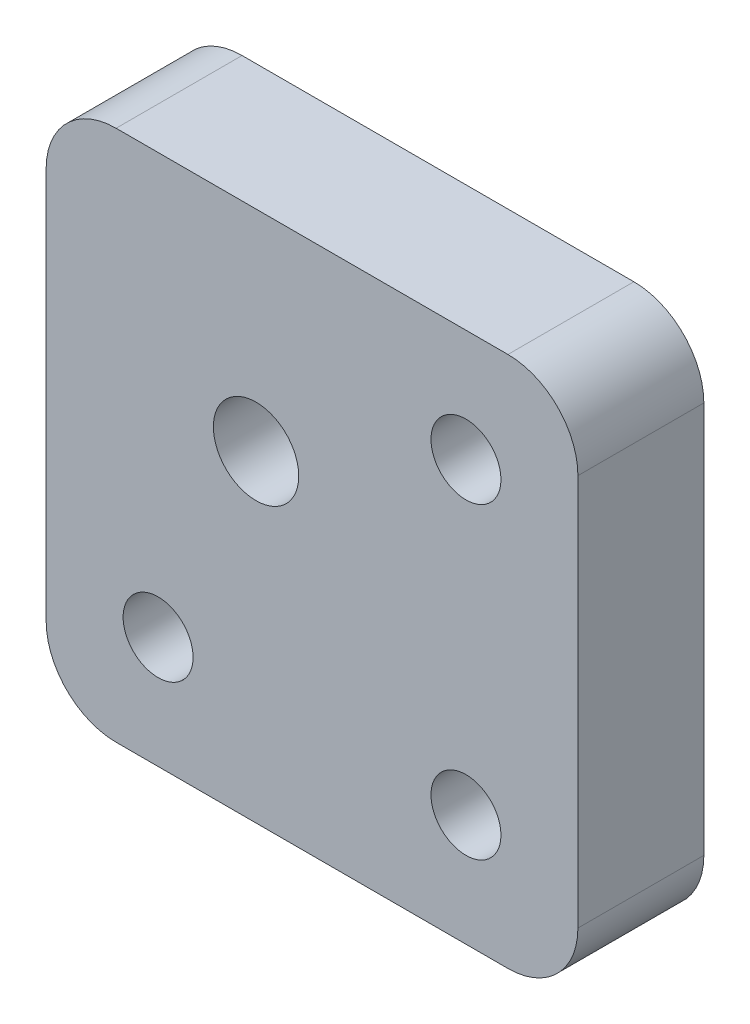
ISO-10303-21;
HEADER;
FILE_DESCRIPTION(('STEP AP214'),'2;1');
FILE_NAME('part.step','',(''),(''),'','','');
FILE_SCHEMA(('AUTOMOTIVE_DESIGN { 1 0 10303 214 1 1 1 1 }'));
ENDSEC;
DATA;
#1=APPLICATION_CONTEXT('core data for automotive mechanical design processes');
#2=APPLICATION_PROTOCOL_DEFINITION('international standard','automotive_design',2000,#1);
#3=PRODUCT_CONTEXT('',#1,'mechanical');
#4=PRODUCT('Part','Part','',(#3));
#5=PRODUCT_RELATED_PRODUCT_CATEGORY('part','',(#4));
#6=PRODUCT_DEFINITION_FORMATION('','',#4);
#7=PRODUCT_DEFINITION_CONTEXT('part definition',#1,'design');
#8=PRODUCT_DEFINITION('design','',#6,#7);
#9=PRODUCT_DEFINITION_SHAPE('','',#8);
#10=(LENGTH_UNIT() NAMED_UNIT(*) SI_UNIT(.MILLI.,.METRE.));
#11=(NAMED_UNIT(*) PLANE_ANGLE_UNIT() SI_UNIT($,.RADIAN.));
#12=(NAMED_UNIT(*) SI_UNIT($,.STERADIAN.) SOLID_ANGLE_UNIT());
#13=UNCERTAINTY_MEASURE_WITH_UNIT(LENGTH_MEASURE(1.E-05),#10,'distance_accuracy_value','');
#14=(GEOMETRIC_REPRESENTATION_CONTEXT(3) GLOBAL_UNCERTAINTY_ASSIGNED_CONTEXT((#13)) GLOBAL_UNIT_ASSIGNED_CONTEXT((#10,
#11,#12)) REPRESENTATION_CONTEXT('',''));
#15=CARTESIAN_POINT('',(0.,0.,0.));
#16=DIRECTION('',(0.,0.,1.));
#17=DIRECTION('',(1.,0.,0.));
#18=AXIS2_PLACEMENT_3D('',#15,#16,#17);
#19=CARTESIAN_POINT('',(0.,0.,9.));
#20=DIRECTION('',(0.,0.,1.));
#21=DIRECTION('',(1.,0.,0.));
#22=AXIS2_PLACEMENT_3D('',#19,#20,#21);
#23=PLANE('',#22);
#24=CARTESIAN_POINT('',(-13.1697995889595,-10.1602209944751,9.));
#25=DIRECTION('',(0.,0.,1.));
#26=DIRECTION('',(1.,0.,0.));
#27=AXIS2_PLACEMENT_3D('',#24,#25,#26);
#28=CIRCLE('',#27,2.5);
#29=CARTESIAN_POINT('',(-10.6697995889595,-10.1602209944751,9.));
#30=VERTEX_POINT('',#29);
#31=EDGE_CURVE('E188',#30,#30,#28,.T.);
#32=ORIENTED_EDGE('',*,*,#31,.F.);
#33=EDGE_LOOP('',(#32));
#34=FACE_BOUND('',#33,.T.);
#35=CARTESIAN_POINT('',(8.83020041104048,11.8397790055249,9.));
#36=DIRECTION('',(0.,0.,1.));
#37=DIRECTION('',(1.,0.,0.));
#38=AXIS2_PLACEMENT_3D('',#35,#36,#37);
#39=CIRCLE('',#38,2.5);
#40=CARTESIAN_POINT('',(11.3302004110405,11.8397790055249,9.));
#41=VERTEX_POINT('',#40);
#42=EDGE_CURVE('E129',#41,#41,#39,.T.);
#43=ORIENTED_EDGE('',*,*,#42,.F.);
#44=EDGE_LOOP('',(#43));
#45=FACE_BOUND('',#44,.T.);
#46=DIRECTION('',(-1.,0.,0.));
#47=VECTOR('',#46,1.);
#48=CARTESIAN_POINT('',(-21.1697995889595,19.8397790055249,9.));
#49=LINE('',#48,#47);
#50=CARTESIAN_POINT('',(11.8302004110405,19.8397790055249,9.));
#51=VERTEX_POINT('',#50);
#52=CARTESIAN_POINT('',(-16.1697995889595,19.8397790055249,9.));
#53=VERTEX_POINT('',#52);
#54=EDGE_CURVE('E138',#51,#53,#49,.T.);
#55=ORIENTED_EDGE('',*,*,#54,.T.);
#56=CARTESIAN_POINT('',(-16.1697995889595,14.8397790055249,9.));
#57=DIRECTION('',(0.,0.,1.));
#58=DIRECTION('',(1.,0.,0.));
#59=AXIS2_PLACEMENT_3D('',#56,#57,#58);
#60=CIRCLE('',#59,5.);
#61=CARTESIAN_POINT('',(-21.1697995889595,14.8397790055249,9.));
#62=VERTEX_POINT('',#61);
#63=EDGE_CURVE('E157',#53,#62,#60,.T.);
#64=ORIENTED_EDGE('',*,*,#63,.T.);
#65=DIRECTION('',(0.,-1.,0.));
#66=VECTOR('',#65,1.);
#67=CARTESIAN_POINT('',(-21.1697995889595,19.8397790055249,9.));
#68=LINE('',#67,#66);
#69=CARTESIAN_POINT('',(-21.1697995889595,-13.1602209944751,9.));
#70=VERTEX_POINT('',#69);
#71=EDGE_CURVE('E121',#62,#70,#68,.T.);
#72=ORIENTED_EDGE('',*,*,#71,.T.);
#73=CARTESIAN_POINT('',(-16.1697995889595,-13.1602209944751,9.));
#74=DIRECTION('',(0.,0.,1.));
#75=DIRECTION('',(1.,0.,0.));
#76=AXIS2_PLACEMENT_3D('',#73,#74,#75);
#77=CIRCLE('',#76,5.);
#78=CARTESIAN_POINT('',(-16.1697995889595,-18.1602209944751,9.));
#79=VERTEX_POINT('',#78);
#80=EDGE_CURVE('E155',#70,#79,#77,.T.);
#81=ORIENTED_EDGE('',*,*,#80,.T.);
#82=DIRECTION('',(1.,0.,0.));
#83=VECTOR('',#82,1.);
#84=CARTESIAN_POINT('',(-21.1697995889595,-18.1602209944751,9.));
#85=LINE('',#84,#83);
#86=CARTESIAN_POINT('',(11.8302004110405,-18.1602209944751,9.));
#87=VERTEX_POINT('',#86);
#88=EDGE_CURVE('E168',#79,#87,#85,.T.);
#89=ORIENTED_EDGE('',*,*,#88,.T.);
#90=CARTESIAN_POINT('',(11.8302004110405,-13.1602209944751,9.));
#91=DIRECTION('',(0.,0.,1.));
#92=DIRECTION('',(1.,0.,0.));
#93=AXIS2_PLACEMENT_3D('',#90,#91,#92);
#94=CIRCLE('',#93,5.);
#95=CARTESIAN_POINT('',(16.8302004110405,-13.1602209944751,9.));
#96=VERTEX_POINT('',#95);
#97=EDGE_CURVE('E56',#87,#96,#94,.T.);
#98=ORIENTED_EDGE('',*,*,#97,.T.);
#99=DIRECTION('',(0.,1.,0.));
#100=VECTOR('',#99,1.);
#101=CARTESIAN_POINT('',(16.8302004110405,19.8397790055249,9.));
#102=LINE('',#101,#100);
#103=CARTESIAN_POINT('',(16.8302004110405,14.8397790055249,9.));
#104=VERTEX_POINT('',#103);
#105=EDGE_CURVE('E176',#96,#104,#102,.T.);
#106=ORIENTED_EDGE('',*,*,#105,.T.);
#107=CARTESIAN_POINT('',(11.8302004110405,14.8397790055249,9.));
#108=DIRECTION('',(0.,0.,1.));
#109=DIRECTION('',(1.,0.,0.));
#110=AXIS2_PLACEMENT_3D('',#107,#108,#109);
#111=CIRCLE('',#110,5.);
#112=EDGE_CURVE('E152',#104,#51,#111,.T.);
#113=ORIENTED_EDGE('',*,*,#112,.T.);
#114=EDGE_LOOP('',(#55,#64,#72,#81,#89,#98,#106,#113));
#115=FACE_BOUND('',#114,.T.);
#116=CARTESIAN_POINT('',(8.83020041104049,-10.1602209944751,9.));
#117=DIRECTION('',(0.,0.,1.));
#118=DIRECTION('',(1.,0.,0.));
#119=AXIS2_PLACEMENT_3D('',#116,#117,#118);
#120=CIRCLE('',#119,2.5);
#121=CARTESIAN_POINT('',(11.3302004110405,-10.1602209944751,9.));
#122=VERTEX_POINT('',#121);
#123=EDGE_CURVE('E183',#122,#122,#120,.T.);
#124=ORIENTED_EDGE('',*,*,#123,.F.);
#125=EDGE_LOOP('',(#124));
#126=FACE_BOUND('',#125,.T.);
#127=CARTESIAN_POINT('',(-6.16979958895952,4.83977900552487,9.));
#128=DIRECTION('',(0.,0.,1.));
#129=DIRECTION('',(1.,0.,0.));
#130=AXIS2_PLACEMENT_3D('',#127,#128,#129);
#131=CIRCLE('',#130,3.05);
#132=CARTESIAN_POINT('',(-3.11979958895952,4.83977900552487,9.));
#133=VERTEX_POINT('',#132);
#134=EDGE_CURVE('E194',#133,#133,#131,.T.);
#135=ORIENTED_EDGE('',*,*,#134,.F.);
#136=EDGE_LOOP('',(#135));
#137=FACE_BOUND('',#136,.T.);
#138=ADVANCED_FACE('F35',(#34,#45,#115,#126,#137),#23,.T.);
#139=CARTESIAN_POINT('',(0.,0.,0.));
#140=DIRECTION('',(0.,0.,1.));
#141=DIRECTION('',(1.,0.,0.));
#142=AXIS2_PLACEMENT_3D('',#139,#140,#141);
#143=PLANE('',#142);
#144=DIRECTION('',(0.,-1.,0.));
#145=VECTOR('',#144,1.);
#146=CARTESIAN_POINT('',(-21.1697995889595,19.8397790055249,0.));
#147=LINE('',#146,#145);
#148=CARTESIAN_POINT('',(-21.1697995889595,14.8397790055249,0.));
#149=VERTEX_POINT('',#148);
#150=CARTESIAN_POINT('',(-21.1697995889595,-13.1602209944751,0.));
#151=VERTEX_POINT('',#150);
#152=EDGE_CURVE('E118',#149,#151,#147,.T.);
#153=ORIENTED_EDGE('',*,*,#152,.F.);
#154=CARTESIAN_POINT('',(-16.1697995889595,14.8397790055249,0.));
#155=DIRECTION('',(0.,0.,1.));
#156=DIRECTION('',(1.,0.,0.));
#157=AXIS2_PLACEMENT_3D('',#154,#155,#156);
#158=CIRCLE('',#157,5.);
#159=CARTESIAN_POINT('',(-16.1697995889595,19.8397790055249,0.));
#160=VERTEX_POINT('',#159);
#161=EDGE_CURVE('E101',#149,#160,#158,.F.);
#162=ORIENTED_EDGE('',*,*,#161,.T.);
#163=DIRECTION('',(-1.,0.,0.));
#164=VECTOR('',#163,1.);
#165=CARTESIAN_POINT('',(-21.1697995889595,19.8397790055249,0.));
#166=LINE('',#165,#164);
#167=CARTESIAN_POINT('',(11.8302004110405,19.8397790055249,0.));
#168=VERTEX_POINT('',#167);
#169=EDGE_CURVE('E142',#168,#160,#166,.T.);
#170=ORIENTED_EDGE('',*,*,#169,.F.);
#171=CARTESIAN_POINT('',(11.8302004110405,14.8397790055249,0.));
#172=DIRECTION('',(0.,0.,1.));
#173=DIRECTION('',(1.,0.,0.));
#174=AXIS2_PLACEMENT_3D('',#171,#172,#173);
#175=CIRCLE('',#174,5.);
#176=CARTESIAN_POINT('',(16.8302004110405,14.8397790055249,0.));
#177=VERTEX_POINT('',#176);
#178=EDGE_CURVE('E122',#168,#177,#175,.F.);
#179=ORIENTED_EDGE('',*,*,#178,.T.);
#180=DIRECTION('',(0.,1.,0.));
#181=VECTOR('',#180,1.);
#182=CARTESIAN_POINT('',(16.8302004110405,19.8397790055249,0.));
#183=LINE('',#182,#181);
#184=CARTESIAN_POINT('',(16.8302004110405,-13.1602209944751,0.));
#185=VERTEX_POINT('',#184);
#186=EDGE_CURVE('E132',#185,#177,#183,.T.);
#187=ORIENTED_EDGE('',*,*,#186,.F.);
#188=CARTESIAN_POINT('',(11.8302004110405,-13.1602209944751,0.));
#189=DIRECTION('',(0.,0.,1.));
#190=DIRECTION('',(1.,0.,0.));
#191=AXIS2_PLACEMENT_3D('',#188,#189,#190);
#192=CIRCLE('',#191,5.);
#193=CARTESIAN_POINT('',(11.8302004110405,-18.1602209944751,0.));
#194=VERTEX_POINT('',#193);
#195=EDGE_CURVE('E146',#185,#194,#192,.F.);
#196=ORIENTED_EDGE('',*,*,#195,.T.);
#197=DIRECTION('',(1.,0.,0.));
#198=VECTOR('',#197,1.);
#199=CARTESIAN_POINT('',(-21.1697995889595,-18.1602209944751,0.));
#200=LINE('',#199,#198);
#201=CARTESIAN_POINT('',(-16.1697995889595,-18.1602209944751,0.));
#202=VERTEX_POINT('',#201);
#203=EDGE_CURVE('E128',#202,#194,#200,.T.);
#204=ORIENTED_EDGE('',*,*,#203,.F.);
#205=CARTESIAN_POINT('',(-16.1697995889595,-13.1602209944751,0.));
#206=DIRECTION('',(0.,0.,1.));
#207=DIRECTION('',(1.,0.,0.));
#208=AXIS2_PLACEMENT_3D('',#205,#206,#207);
#209=CIRCLE('',#208,5.);
#210=EDGE_CURVE('E112',#202,#151,#209,.F.);
#211=ORIENTED_EDGE('',*,*,#210,.T.);
#212=EDGE_LOOP('',(#153,#162,#170,#179,#187,#196,#204,#211));
#213=FACE_BOUND('',#212,.T.);
#214=CARTESIAN_POINT('',(8.83020041104048,11.8397790055249,0.));
#215=DIRECTION('',(0.,0.,1.));
#216=DIRECTION('',(1.,0.,0.));
#217=AXIS2_PLACEMENT_3D('',#214,#215,#216);
#218=CIRCLE('',#217,2.5);
#219=CARTESIAN_POINT('',(11.3302004110405,11.8397790055249,0.));
#220=VERTEX_POINT('',#219);
#221=EDGE_CURVE('E135',#220,#220,#218,.T.);
#222=ORIENTED_EDGE('',*,*,#221,.T.);
#223=EDGE_LOOP('',(#222));
#224=FACE_BOUND('',#223,.T.);
#225=CARTESIAN_POINT('',(8.83020041104049,-10.1602209944751,0.));
#226=DIRECTION('',(0.,0.,1.));
#227=DIRECTION('',(1.,0.,0.));
#228=AXIS2_PLACEMENT_3D('',#225,#226,#227);
#229=CIRCLE('',#228,2.5);
#230=CARTESIAN_POINT('',(11.3302004110405,-10.1602209944751,0.));
#231=VERTEX_POINT('',#230);
#232=EDGE_CURVE('E185',#231,#231,#229,.T.);
#233=ORIENTED_EDGE('',*,*,#232,.T.);
#234=EDGE_LOOP('',(#233));
#235=FACE_BOUND('',#234,.T.);
#236=CARTESIAN_POINT('',(-13.1697995889595,-10.1602209944751,0.));
#237=DIRECTION('',(0.,0.,1.));
#238=DIRECTION('',(1.,0.,0.));
#239=AXIS2_PLACEMENT_3D('',#236,#237,#238);
#240=CIRCLE('',#239,2.5);
#241=CARTESIAN_POINT('',(-10.6697995889595,-10.1602209944751,0.));
#242=VERTEX_POINT('',#241);
#243=EDGE_CURVE('E191',#242,#242,#240,.T.);
#244=ORIENTED_EDGE('',*,*,#243,.T.);
#245=EDGE_LOOP('',(#244));
#246=FACE_BOUND('',#245,.T.);
#247=CARTESIAN_POINT('',(-6.16979958895952,4.83977900552487,0.));
#248=DIRECTION('',(0.,0.,1.));
#249=DIRECTION('',(1.,0.,0.));
#250=AXIS2_PLACEMENT_3D('',#247,#248,#249);
#251=CIRCLE('',#250,3.05);
#252=CARTESIAN_POINT('',(-3.11979958895952,4.83977900552487,0.));
#253=VERTEX_POINT('',#252);
#254=EDGE_CURVE('E197',#253,#253,#251,.T.);
#255=ORIENTED_EDGE('',*,*,#254,.T.);
#256=EDGE_LOOP('',(#255));
#257=FACE_BOUND('',#256,.T.);
#258=ADVANCED_FACE('F125',(#213,#224,#235,#246,#257),#143,.F.);
#259=CARTESIAN_POINT('',(-21.1697995889595,19.8397790055249,9.));
#260=DIRECTION('',(1.,0.,0.));
#261=DIRECTION('',(0.,1.,0.));
#262=AXIS2_PLACEMENT_3D('',#259,#260,#261);
#263=PLANE('',#262);
#264=ORIENTED_EDGE('',*,*,#71,.F.);
#265=DIRECTION('',(0.,0.,-1.));
#266=VECTOR('',#265,1.);
#267=CARTESIAN_POINT('',(-21.1697995889595,14.8397790055249,9.));
#268=LINE('',#267,#266);
#269=EDGE_CURVE('E105',#62,#149,#268,.T.);
#270=ORIENTED_EDGE('',*,*,#269,.T.);
#271=ORIENTED_EDGE('',*,*,#152,.T.);
#272=DIRECTION('',(0.,0.,-1.));
#273=VECTOR('',#272,1.);
#274=CARTESIAN_POINT('',(-21.1697995889595,-13.1602209944751,9.));
#275=LINE('',#274,#273);
#276=EDGE_CURVE('E123',#151,#70,#275,.F.);
#277=ORIENTED_EDGE('',*,*,#276,.T.);
#278=EDGE_LOOP('',(#264,#270,#271,#277));
#279=FACE_BOUND('',#278,.T.);
#280=ADVANCED_FACE('F117',(#279),#263,.F.);
#281=CARTESIAN_POINT('',(-21.1697995889595,-18.1602209944751,9.));
#282=DIRECTION('',(0.,1.,0.));
#283=DIRECTION('',(0.,0.,1.));
#284=AXIS2_PLACEMENT_3D('',#281,#282,#283);
#285=PLANE('',#284);
#286=ORIENTED_EDGE('',*,*,#88,.F.);
#287=DIRECTION('',(0.,0.,-1.));
#288=VECTOR('',#287,1.);
#289=CARTESIAN_POINT('',(-16.1697995889595,-18.1602209944751,9.));
#290=LINE('',#289,#288);
#291=EDGE_CURVE('E161',#79,#202,#290,.T.);
#292=ORIENTED_EDGE('',*,*,#291,.T.);
#293=ORIENTED_EDGE('',*,*,#203,.T.);
#294=DIRECTION('',(0.,0.,-1.));
#295=VECTOR('',#294,1.);
#296=CARTESIAN_POINT('',(11.8302004110405,-18.1602209944751,9.));
#297=LINE('',#296,#295);
#298=EDGE_CURVE('E159',#194,#87,#297,.F.);
#299=ORIENTED_EDGE('',*,*,#298,.T.);
#300=EDGE_LOOP('',(#286,#292,#293,#299));
#301=FACE_BOUND('',#300,.T.);
#302=ADVANCED_FACE('F166',(#301),#285,.F.);
#303=CARTESIAN_POINT('',(16.8302004110405,19.8397790055249,9.));
#304=DIRECTION('',(-1.,0.,0.));
#305=DIRECTION('',(0.,-1.,0.));
#306=AXIS2_PLACEMENT_3D('',#303,#304,#305);
#307=PLANE('',#306);
#308=ORIENTED_EDGE('',*,*,#105,.F.);
#309=DIRECTION('',(0.,0.,-1.));
#310=VECTOR('',#309,1.);
#311=CARTESIAN_POINT('',(16.8302004110405,-13.1602209944751,9.));
#312=LINE('',#311,#310);
#313=EDGE_CURVE('E11',#96,#185,#312,.T.);
#314=ORIENTED_EDGE('',*,*,#313,.T.);
#315=ORIENTED_EDGE('',*,*,#186,.T.);
#316=DIRECTION('',(0.,0.,-1.));
#317=VECTOR('',#316,1.);
#318=CARTESIAN_POINT('',(16.8302004110405,14.8397790055249,9.));
#319=LINE('',#318,#317);
#320=EDGE_CURVE('E43',#177,#104,#319,.F.);
#321=ORIENTED_EDGE('',*,*,#320,.T.);
#322=EDGE_LOOP('',(#308,#314,#315,#321));
#323=FACE_BOUND('',#322,.T.);
#324=ADVANCED_FACE('F175',(#323),#307,.F.);
#325=CARTESIAN_POINT('',(-21.1697995889595,19.8397790055249,9.));
#326=DIRECTION('',(0.,-1.,0.));
#327=DIRECTION('',(1.,0.,0.));
#328=AXIS2_PLACEMENT_3D('',#325,#326,#327);
#329=PLANE('',#328);
#330=ORIENTED_EDGE('',*,*,#169,.T.);
#331=DIRECTION('',(0.,0.,-1.));
#332=VECTOR('',#331,1.);
#333=CARTESIAN_POINT('',(-16.1697995889595,19.8397790055249,9.));
#334=LINE('',#333,#332);
#335=EDGE_CURVE('E106',#160,#53,#334,.F.);
#336=ORIENTED_EDGE('',*,*,#335,.T.);
#337=ORIENTED_EDGE('',*,*,#54,.F.);
#338=DIRECTION('',(0.,0.,-1.));
#339=VECTOR('',#338,1.);
#340=CARTESIAN_POINT('',(11.8302004110405,19.8397790055249,9.));
#341=LINE('',#340,#339);
#342=EDGE_CURVE('E111',#51,#168,#341,.T.);
#343=ORIENTED_EDGE('',*,*,#342,.T.);
#344=EDGE_LOOP('',(#330,#336,#337,#343));
#345=FACE_BOUND('',#344,.T.);
#346=ADVANCED_FACE('F219',(#345),#329,.F.);
#347=CARTESIAN_POINT('',(8.83020041104048,11.8397790055249,9.));
#348=DIRECTION('',(0.,0.,-1.));
#349=DIRECTION('',(-1.,0.,0.));
#350=AXIS2_PLACEMENT_3D('',#347,#348,#349);
#351=CYLINDRICAL_SURFACE('',#350,2.5);
#352=ORIENTED_EDGE('',*,*,#42,.T.);
#353=EDGE_LOOP('',(#352));
#354=FACE_BOUND('',#353,.T.);
#355=ORIENTED_EDGE('',*,*,#221,.F.);
#356=EDGE_LOOP('',(#355));
#357=FACE_BOUND('',#356,.T.);
#358=ADVANCED_FACE('F216',(#354,#357),#351,.F.);
#359=CARTESIAN_POINT('',(8.83020041104049,-10.1602209944751,9.));
#360=DIRECTION('',(0.,0.,-1.));
#361=DIRECTION('',(-1.,0.,0.));
#362=AXIS2_PLACEMENT_3D('',#359,#360,#361);
#363=CYLINDRICAL_SURFACE('',#362,2.5);
#364=ORIENTED_EDGE('',*,*,#123,.T.);
#365=EDGE_LOOP('',(#364));
#366=FACE_BOUND('',#365,.T.);
#367=ORIENTED_EDGE('',*,*,#232,.F.);
#368=EDGE_LOOP('',(#367));
#369=FACE_BOUND('',#368,.T.);
#370=ADVANCED_FACE('F245',(#366,#369),#363,.F.);
#371=CARTESIAN_POINT('',(-13.1697995889595,-10.1602209944751,9.));
#372=DIRECTION('',(0.,0.,-1.));
#373=DIRECTION('',(-1.,0.,0.));
#374=AXIS2_PLACEMENT_3D('',#371,#372,#373);
#375=CYLINDRICAL_SURFACE('',#374,2.5);
#376=ORIENTED_EDGE('',*,*,#31,.T.);
#377=EDGE_LOOP('',(#376));
#378=FACE_BOUND('',#377,.T.);
#379=ORIENTED_EDGE('',*,*,#243,.F.);
#380=EDGE_LOOP('',(#379));
#381=FACE_BOUND('',#380,.T.);
#382=ADVANCED_FACE('F248',(#378,#381),#375,.F.);
#383=CARTESIAN_POINT('',(-6.16979958895952,4.83977900552487,9.));
#384=DIRECTION('',(0.,0.,-1.));
#385=DIRECTION('',(-1.,0.,0.));
#386=AXIS2_PLACEMENT_3D('',#383,#384,#385);
#387=CYLINDRICAL_SURFACE('',#386,3.05);
#388=ORIENTED_EDGE('',*,*,#134,.T.);
#389=EDGE_LOOP('',(#388));
#390=FACE_BOUND('',#389,.T.);
#391=ORIENTED_EDGE('',*,*,#254,.F.);
#392=EDGE_LOOP('',(#391));
#393=FACE_BOUND('',#392,.T.);
#394=ADVANCED_FACE('F203',(#390,#393),#387,.F.);
#395=CARTESIAN_POINT('',(-16.1697995889595,14.8397790055249,9.));
#396=DIRECTION('',(0.,0.,-1.));
#397=DIRECTION('',(-1.,0.,0.));
#398=AXIS2_PLACEMENT_3D('',#395,#396,#397);
#399=CYLINDRICAL_SURFACE('',#398,5.);
#400=ORIENTED_EDGE('',*,*,#63,.F.);
#401=ORIENTED_EDGE('',*,*,#335,.F.);
#402=ORIENTED_EDGE('',*,*,#161,.F.);
#403=ORIENTED_EDGE('',*,*,#269,.F.);
#404=EDGE_LOOP('',(#400,#401,#402,#403));
#405=FACE_BOUND('',#404,.T.);
#406=ADVANCED_FACE('F104',(#405),#399,.T.);
#407=CARTESIAN_POINT('',(-16.1697995889595,-13.1602209944751,9.));
#408=DIRECTION('',(0.,0.,-1.));
#409=DIRECTION('',(-1.,0.,0.));
#410=AXIS2_PLACEMENT_3D('',#407,#408,#409);
#411=CYLINDRICAL_SURFACE('',#410,5.);
#412=ORIENTED_EDGE('',*,*,#80,.F.);
#413=ORIENTED_EDGE('',*,*,#276,.F.);
#414=ORIENTED_EDGE('',*,*,#210,.F.);
#415=ORIENTED_EDGE('',*,*,#291,.F.);
#416=EDGE_LOOP('',(#412,#413,#414,#415));
#417=FACE_BOUND('',#416,.T.);
#418=ADVANCED_FACE('F231',(#417),#411,.T.);
#419=CARTESIAN_POINT('',(11.8302004110405,-13.1602209944751,9.));
#420=DIRECTION('',(0.,0.,-1.));
#421=DIRECTION('',(-1.,0.,0.));
#422=AXIS2_PLACEMENT_3D('',#419,#420,#421);
#423=CYLINDRICAL_SURFACE('',#422,5.);
#424=ORIENTED_EDGE('',*,*,#97,.F.);
#425=ORIENTED_EDGE('',*,*,#298,.F.);
#426=ORIENTED_EDGE('',*,*,#195,.F.);
#427=ORIENTED_EDGE('',*,*,#313,.F.);
#428=EDGE_LOOP('',(#424,#425,#426,#427));
#429=FACE_BOUND('',#428,.T.);
#430=ADVANCED_FACE('F174',(#429),#423,.T.);
#431=CARTESIAN_POINT('',(11.8302004110405,14.8397790055249,9.));
#432=DIRECTION('',(0.,0.,-1.));
#433=DIRECTION('',(-1.,0.,0.));
#434=AXIS2_PLACEMENT_3D('',#431,#432,#433);
#435=CYLINDRICAL_SURFACE('',#434,5.);
#436=ORIENTED_EDGE('',*,*,#112,.F.);
#437=ORIENTED_EDGE('',*,*,#320,.F.);
#438=ORIENTED_EDGE('',*,*,#178,.F.);
#439=ORIENTED_EDGE('',*,*,#342,.F.);
#440=EDGE_LOOP('',(#436,#437,#438,#439));
#441=FACE_BOUND('',#440,.T.);
#442=ADVANCED_FACE('F37',(#441),#435,.T.);
#443=CLOSED_SHELL('',(#138,#258,#280,#302,#324,#346,#358,#370,#382,#394,#406,#418,#430,#442));
#444=MANIFOLD_SOLID_BREP('B2',#443);
#445=ADVANCED_BREP_SHAPE_REPRESENTATION('',(#18,#444),#14);
#446=SHAPE_DEFINITION_REPRESENTATION(#9,#445);
ENDSEC;
END-ISO-10303-21;
